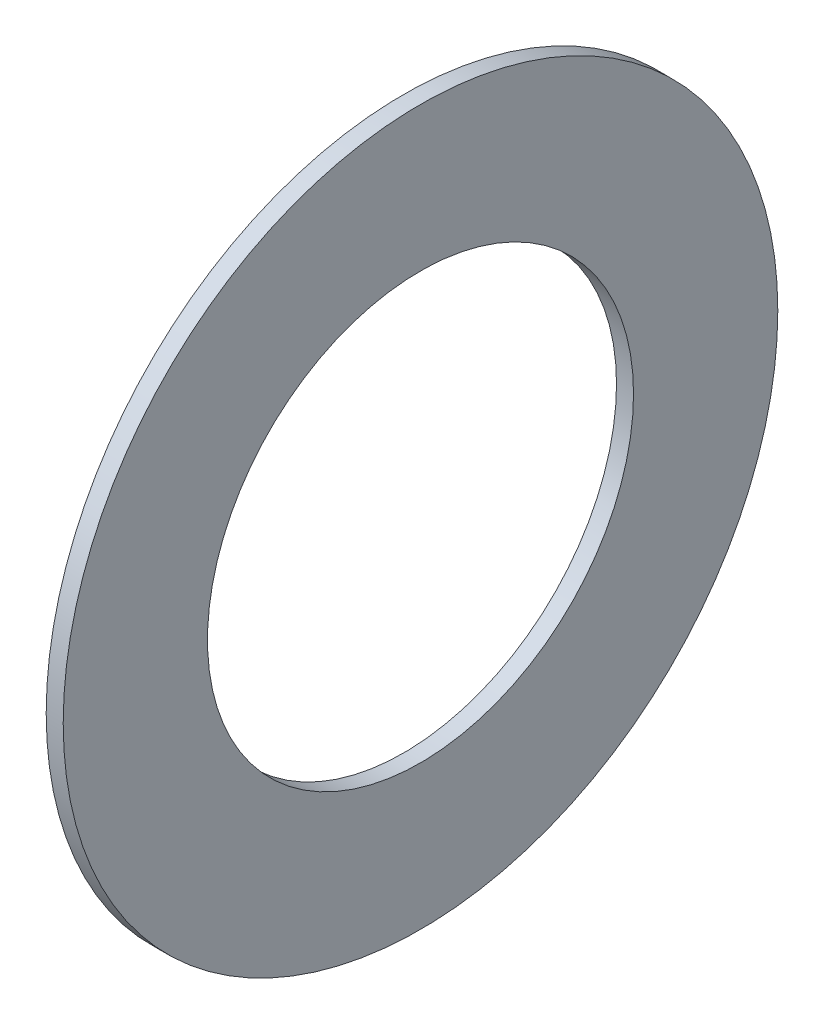
ISO-10303-21;
HEADER;
FILE_DESCRIPTION(('STEP AP214'),'2;1');
FILE_NAME('part.step','',(''),(''),'','','');
FILE_SCHEMA(('AUTOMOTIVE_DESIGN { 1 0 10303 214 1 1 1 1 }'));
ENDSEC;
DATA;
#1=APPLICATION_CONTEXT('core data for automotive mechanical design processes');
#2=APPLICATION_PROTOCOL_DEFINITION('international standard','automotive_design',2000,#1);
#3=PRODUCT_CONTEXT('',#1,'mechanical');
#4=PRODUCT('Part','Part','',(#3));
#5=PRODUCT_RELATED_PRODUCT_CATEGORY('part','',(#4));
#6=PRODUCT_DEFINITION_FORMATION('','',#4);
#7=PRODUCT_DEFINITION_CONTEXT('part definition',#1,'design');
#8=PRODUCT_DEFINITION('design','',#6,#7);
#9=PRODUCT_DEFINITION_SHAPE('','',#8);
#10=(LENGTH_UNIT() NAMED_UNIT(*) SI_UNIT(.MILLI.,.METRE.));
#11=(NAMED_UNIT(*) PLANE_ANGLE_UNIT() SI_UNIT($,.RADIAN.));
#12=(NAMED_UNIT(*) SI_UNIT($,.STERADIAN.) SOLID_ANGLE_UNIT());
#13=UNCERTAINTY_MEASURE_WITH_UNIT(LENGTH_MEASURE(1.E-05),#10,'distance_accuracy_value','');
#14=(GEOMETRIC_REPRESENTATION_CONTEXT(3) GLOBAL_UNCERTAINTY_ASSIGNED_CONTEXT((#13)) GLOBAL_UNIT_ASSIGNED_CONTEXT((#10,
#11,#12)) REPRESENTATION_CONTEXT('',''));
#15=CARTESIAN_POINT('',(0.,0.,0.));
#16=DIRECTION('',(0.,0.,1.));
#17=DIRECTION('',(1.,0.,0.));
#18=AXIS2_PLACEMENT_3D('',#15,#16,#17);
#19=CARTESIAN_POINT('',(0.499999999999975,0.,0.));
#20=DIRECTION('',(1.,0.,0.));
#21=DIRECTION('',(0.,0.,-1.));
#22=AXIS2_PLACEMENT_3D('',#19,#20,#21);
#23=PLANE('',#22);
#24=CARTESIAN_POINT('',(0.499999999999975,0.,0.));
#25=DIRECTION('',(1.,0.,0.));
#26=DIRECTION('',(0.,0.,-1.));
#27=AXIS2_PLACEMENT_3D('',#24,#25,#26);
#28=CIRCLE('',#27,21.);
#29=CARTESIAN_POINT('',(0.499999999999975,0.,-21.));
#30=VERTEX_POINT('',#29);
#31=EDGE_CURVE('E10',#30,#30,#28,.T.);
#32=ORIENTED_EDGE('',*,*,#31,.T.);
#33=EDGE_LOOP('',(#32));
#34=FACE_BOUND('',#33,.T.);
#35=CARTESIAN_POINT('',(0.499999999999975,0.,0.));
#36=DIRECTION('',(1.,0.,0.));
#37=DIRECTION('',(0.,0.,-1.));
#38=AXIS2_PLACEMENT_3D('',#35,#36,#37);
#39=CIRCLE('',#38,12.52);
#40=CARTESIAN_POINT('',(0.499999999999975,0.,-12.52));
#41=VERTEX_POINT('',#40);
#42=EDGE_CURVE('E37',#41,#41,#39,.T.);
#43=ORIENTED_EDGE('',*,*,#42,.F.);
#44=EDGE_LOOP('',(#43));
#45=FACE_BOUND('',#44,.T.);
#46=ADVANCED_FACE('F30',(#34,#45),#23,.T.);
#47=CARTESIAN_POINT('',(0.499999999999975,0.,0.));
#48=DIRECTION('',(-1.,0.,0.));
#49=DIRECTION('',(0.,0.,1.));
#50=AXIS2_PLACEMENT_3D('',#47,#48,#49);
#51=CYLINDRICAL_SURFACE('',#50,21.);
#52=ORIENTED_EDGE('',*,*,#31,.F.);
#53=EDGE_LOOP('',(#52));
#54=FACE_BOUND('',#53,.T.);
#55=CARTESIAN_POINT('',(-0.500000000000025,0.,0.));
#56=DIRECTION('',(1.,0.,0.));
#57=DIRECTION('',(0.,0.,-1.));
#58=AXIS2_PLACEMENT_3D('',#55,#56,#57);
#59=CIRCLE('',#58,21.);
#60=CARTESIAN_POINT('',(-0.500000000000025,0.,-21.));
#61=VERTEX_POINT('',#60);
#62=EDGE_CURVE('E41',#61,#61,#59,.T.);
#63=ORIENTED_EDGE('',*,*,#62,.T.);
#64=EDGE_LOOP('',(#63));
#65=FACE_BOUND('',#64,.T.);
#66=ADVANCED_FACE('F32',(#54,#65),#51,.T.);
#67=CARTESIAN_POINT('',(0.499999999999975,0.,0.));
#68=DIRECTION('',(-1.,0.,0.));
#69=DIRECTION('',(0.,0.,1.));
#70=AXIS2_PLACEMENT_3D('',#67,#68,#69);
#71=CYLINDRICAL_SURFACE('',#70,12.52);
#72=ORIENTED_EDGE('',*,*,#42,.T.);
#73=EDGE_LOOP('',(#72));
#74=FACE_BOUND('',#73,.T.);
#75=CARTESIAN_POINT('',(-0.500000000000025,0.,0.));
#76=DIRECTION('',(1.,0.,0.));
#77=DIRECTION('',(0.,0.,-1.));
#78=AXIS2_PLACEMENT_3D('',#75,#76,#77);
#79=CIRCLE('',#78,12.52);
#80=CARTESIAN_POINT('',(-0.500000000000025,0.,-12.52));
#81=VERTEX_POINT('',#80);
#82=EDGE_CURVE('E45',#81,#81,#79,.T.);
#83=ORIENTED_EDGE('',*,*,#82,.F.);
#84=EDGE_LOOP('',(#83));
#85=FACE_BOUND('',#84,.T.);
#86=ADVANCED_FACE('F54',(#74,#85),#71,.F.);
#87=CARTESIAN_POINT('',(-0.500000000000025,0.,0.));
#88=DIRECTION('',(1.,0.,0.));
#89=DIRECTION('',(0.,0.,-1.));
#90=AXIS2_PLACEMENT_3D('',#87,#88,#89);
#91=PLANE('',#90);
#92=ORIENTED_EDGE('',*,*,#82,.T.);
#93=EDGE_LOOP('',(#92));
#94=FACE_BOUND('',#93,.T.);
#95=ORIENTED_EDGE('',*,*,#62,.F.);
#96=EDGE_LOOP('',(#95));
#97=FACE_BOUND('',#96,.T.);
#98=ADVANCED_FACE('F51',(#94,#97),#91,.F.);
#99=CLOSED_SHELL('',(#46,#66,#86,#98));
#100=MANIFOLD_SOLID_BREP('B2',#99);
#101=ADVANCED_BREP_SHAPE_REPRESENTATION('',(#18,#100),#14);
#102=SHAPE_DEFINITION_REPRESENTATION(#9,#101);
ENDSEC;
END-ISO-10303-21;
